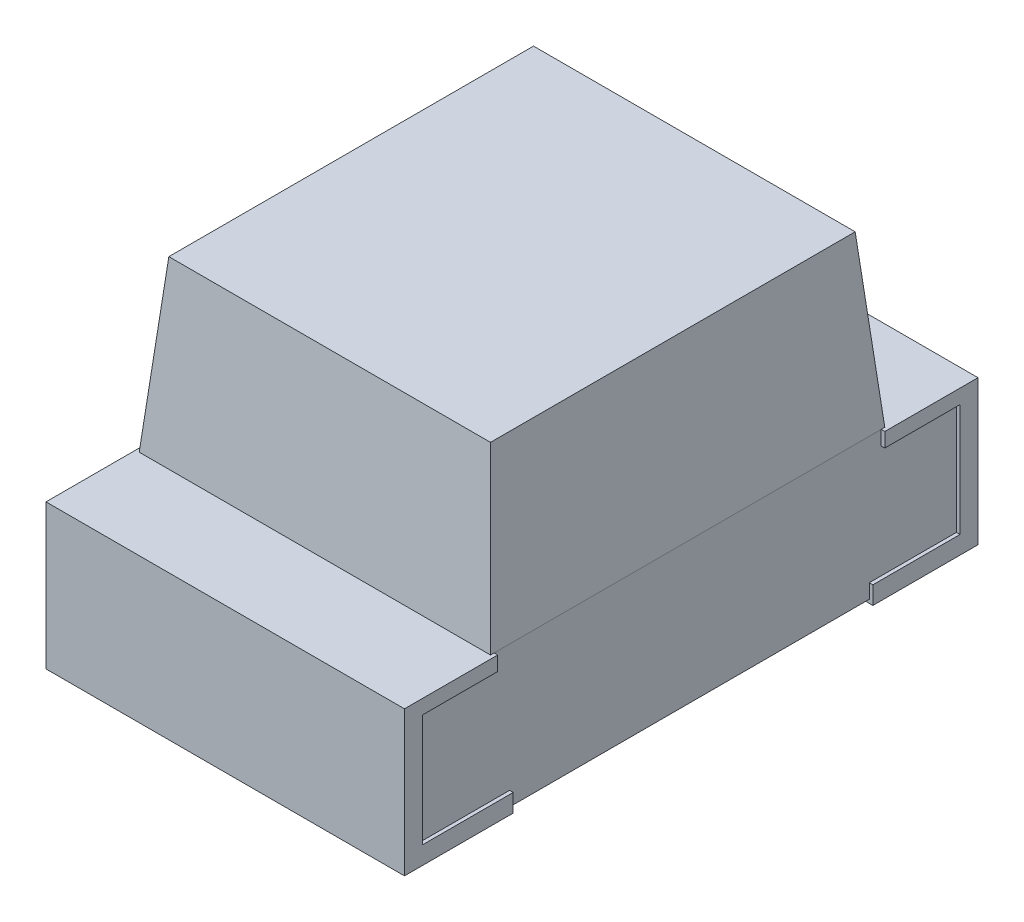
ISO-10303-21;
HEADER;
FILE_DESCRIPTION(('STEP AP214'),'2;1');
FILE_NAME('part.step','',(''),(''),'','','');
FILE_SCHEMA(('AUTOMOTIVE_DESIGN { 1 0 10303 214 1 1 1 1 }'));
ENDSEC;
DATA;
#1=APPLICATION_CONTEXT('core data for automotive mechanical design processes');
#2=APPLICATION_PROTOCOL_DEFINITION('international standard','automotive_design',2000,#1);
#3=PRODUCT_CONTEXT('',#1,'mechanical');
#4=PRODUCT('Part','Part','',(#3));
#5=PRODUCT_RELATED_PRODUCT_CATEGORY('part','',(#4));
#6=PRODUCT_DEFINITION_FORMATION('','',#4);
#7=PRODUCT_DEFINITION_CONTEXT('part definition',#1,'design');
#8=PRODUCT_DEFINITION('design','',#6,#7);
#9=PRODUCT_DEFINITION_SHAPE('','',#8);
#10=(LENGTH_UNIT() NAMED_UNIT(*) SI_UNIT(.MILLI.,.METRE.));
#11=(NAMED_UNIT(*) PLANE_ANGLE_UNIT() SI_UNIT($,.RADIAN.));
#12=(NAMED_UNIT(*) SI_UNIT($,.STERADIAN.) SOLID_ANGLE_UNIT());
#13=UNCERTAINTY_MEASURE_WITH_UNIT(LENGTH_MEASURE(1.E-05),#10,'distance_accuracy_value','');
#14=(GEOMETRIC_REPRESENTATION_CONTEXT(3) GLOBAL_UNCERTAINTY_ASSIGNED_CONTEXT((#13)) GLOBAL_UNIT_ASSIGNED_CONTEXT((#10,
#11,#12)) REPRESENTATION_CONTEXT('',''));
#15=CARTESIAN_POINT('',(0.,0.,0.));
#16=DIRECTION('',(0.,0.,1.));
#17=DIRECTION('',(1.,0.,0.));
#18=AXIS2_PLACEMENT_3D('',#15,#16,#17);
#19=CARTESIAN_POINT('',(-0.6223,0.4492,1.016));
#20=DIRECTION('',(0.,0.,1.));
#21=DIRECTION('',(1.,0.,0.));
#22=AXIS2_PLACEMENT_3D('',#19,#20,#21);
#23=PLANE('',#22);
#24=DIRECTION('',(1.,0.,0.));
#25=VECTOR('',#24,1.);
#26=CARTESIAN_POINT('',(0.6223,0.5,1.016));
#27=LINE('',#26,#25);
#28=CARTESIAN_POINT('',(-0.635,0.5,1.016));
#29=VERTEX_POINT('',#28);
#30=CARTESIAN_POINT('',(0.635,0.5,1.016));
#31=VERTEX_POINT('',#30);
#32=EDGE_CURVE('E20',#29,#31,#27,.T.);
#33=ORIENTED_EDGE('',*,*,#32,.F.);
#34=DIRECTION('',(0.,1.,0.));
#35=VECTOR('',#34,1.);
#36=CARTESIAN_POINT('',(-0.635,0.4492,1.016));
#37=LINE('',#36,#35);
#38=CARTESIAN_POINT('',(-0.635,-0.0127,1.016));
#39=VERTEX_POINT('',#38);
#40=EDGE_CURVE('E319',#39,#29,#37,.T.);
#41=ORIENTED_EDGE('',*,*,#40,.F.);
#42=DIRECTION('',(1.,0.,0.));
#43=VECTOR('',#42,1.);
#44=CARTESIAN_POINT('',(-0.6223,-0.0127,1.016));
#45=LINE('',#44,#43);
#46=CARTESIAN_POINT('',(0.635,-0.0127,1.016));
#47=VERTEX_POINT('',#46);
#48=EDGE_CURVE('E246',#47,#39,#45,.F.);
#49=ORIENTED_EDGE('',*,*,#48,.F.);
#50=DIRECTION('',(0.,1.,0.));
#51=VECTOR('',#50,1.);
#52=CARTESIAN_POINT('',(0.635,0.4492,1.016));
#53=LINE('',#52,#51);
#54=EDGE_CURVE('E224',#31,#47,#53,.F.);
#55=ORIENTED_EDGE('',*,*,#54,.F.);
#56=EDGE_LOOP('',(#33,#41,#49,#55));
#57=FACE_BOUND('',#56,.T.);
#58=ADVANCED_FACE('F17',(#57),#23,.T.);
#59=CARTESIAN_POINT('',(0.6223,0.4492,-1.016));
#60=DIRECTION('',(0.,0.,-1.));
#61=DIRECTION('',(-1.,0.,0.));
#62=AXIS2_PLACEMENT_3D('',#59,#60,#61);
#63=PLANE('',#62);
#64=DIRECTION('',(1.,0.,0.));
#65=VECTOR('',#64,1.);
#66=CARTESIAN_POINT('',(0.6223,0.5,-1.016));
#67=LINE('',#66,#65);
#68=CARTESIAN_POINT('',(0.635,0.5,-1.016));
#69=VERTEX_POINT('',#68);
#70=CARTESIAN_POINT('',(-0.635,0.5,-1.016));
#71=VERTEX_POINT('',#70);
#72=EDGE_CURVE('E243',#69,#71,#67,.F.);
#73=ORIENTED_EDGE('',*,*,#72,.F.);
#74=DIRECTION('',(0.,1.,0.));
#75=VECTOR('',#74,1.);
#76=CARTESIAN_POINT('',(0.635,0.4492,-1.016));
#77=LINE('',#76,#75);
#78=CARTESIAN_POINT('',(0.635,-0.0127,-1.016));
#79=VERTEX_POINT('',#78);
#80=EDGE_CURVE('E423',#79,#69,#77,.T.);
#81=ORIENTED_EDGE('',*,*,#80,.F.);
#82=DIRECTION('',(1.,0.,0.));
#83=VECTOR('',#82,1.);
#84=CARTESIAN_POINT('',(0.6223,-0.0127,-1.016));
#85=LINE('',#84,#83);
#86=CARTESIAN_POINT('',(-0.635,-0.0127,-1.016));
#87=VERTEX_POINT('',#86);
#88=EDGE_CURVE('E280',#87,#79,#85,.T.);
#89=ORIENTED_EDGE('',*,*,#88,.F.);
#90=DIRECTION('',(0.,1.,0.));
#91=VECTOR('',#90,1.);
#92=CARTESIAN_POINT('',(-0.635,0.4492,-1.016));
#93=LINE('',#92,#91);
#94=EDGE_CURVE('E401',#71,#87,#93,.F.);
#95=ORIENTED_EDGE('',*,*,#94,.F.);
#96=EDGE_LOOP('',(#73,#81,#89,#95));
#97=FACE_BOUND('',#96,.T.);
#98=ADVANCED_FACE('F581',(#97),#63,.T.);
#99=CARTESIAN_POINT('',(0.6223,0.5,-1.0033));
#100=DIRECTION('',(0.,1.,0.));
#101=DIRECTION('',(0.,0.,1.));
#102=AXIS2_PLACEMENT_3D('',#99,#100,#101);
#103=PLANE('',#102);
#104=ORIENTED_EDGE('',*,*,#32,.T.);
#105=DIRECTION('',(0.,0.,-1.));
#106=VECTOR('',#105,1.);
#107=CARTESIAN_POINT('',(0.635,0.5,0.6985));
#108=LINE('',#107,#106);
#109=CARTESIAN_POINT('',(0.635,0.5,0.6858));
#110=VERTEX_POINT('',#109);
#111=EDGE_CURVE('E233',#110,#31,#108,.F.);
#112=ORIENTED_EDGE('',*,*,#111,.F.);
#113=DIRECTION('',(-1.,0.,0.));
#114=VECTOR('',#113,1.);
#115=CARTESIAN_POINT('',(-0.6223,0.5,0.6858));
#116=LINE('',#115,#114);
#117=CARTESIAN_POINT('',(0.6223,0.5,0.6858));
#118=VERTEX_POINT('',#117);
#119=EDGE_CURVE('E278',#118,#110,#116,.F.);
#120=ORIENTED_EDGE('',*,*,#119,.F.);
#121=DIRECTION('',(0.,0.,1.));
#122=VECTOR('',#121,1.);
#123=CARTESIAN_POINT('',(0.6223,0.5,0.6985));
#124=LINE('',#123,#122);
#125=CARTESIAN_POINT('',(0.6223,0.5,0.6985));
#126=VERTEX_POINT('',#125);
#127=EDGE_CURVE('E273',#126,#118,#124,.F.);
#128=ORIENTED_EDGE('',*,*,#127,.F.);
#129=DIRECTION('',(1.,0.,0.));
#130=VECTOR('',#129,1.);
#131=CARTESIAN_POINT('',(0.6223,0.5,0.6985));
#132=LINE('',#131,#130);
#133=CARTESIAN_POINT('',(-0.6223,0.5,0.6985));
#134=VERTEX_POINT('',#133);
#135=EDGE_CURVE('E239',#134,#126,#132,.T.);
#136=ORIENTED_EDGE('',*,*,#135,.F.);
#137=DIRECTION('',(0.,0.,1.));
#138=VECTOR('',#137,1.);
#139=CARTESIAN_POINT('',(-0.6223,0.5,0.6985));
#140=LINE('',#139,#138);
#141=CARTESIAN_POINT('',(-0.6223,0.5,0.6858));
#142=VERTEX_POINT('',#141);
#143=EDGE_CURVE('E379',#142,#134,#140,.T.);
#144=ORIENTED_EDGE('',*,*,#143,.F.);
#145=DIRECTION('',(-1.,0.,0.));
#146=VECTOR('',#145,1.);
#147=CARTESIAN_POINT('',(-0.6223,0.5,0.6858));
#148=LINE('',#147,#146);
#149=CARTESIAN_POINT('',(-0.635,0.5,0.6858));
#150=VERTEX_POINT('',#149);
#151=EDGE_CURVE('E381',#150,#142,#148,.F.);
#152=ORIENTED_EDGE('',*,*,#151,.F.);
#153=DIRECTION('',(0.,0.,1.));
#154=VECTOR('',#153,1.);
#155=CARTESIAN_POINT('',(-0.635,0.5,0.6985));
#156=LINE('',#155,#154);
#157=EDGE_CURVE('E236',#29,#150,#156,.F.);
#158=ORIENTED_EDGE('',*,*,#157,.F.);
#159=EDGE_LOOP('',(#104,#112,#120,#128,#136,#144,#152,#158));
#160=FACE_BOUND('',#159,.T.);
#161=ADVANCED_FACE('F231',(#160),#103,.T.);
#162=CARTESIAN_POINT('',(0.6223,0.5,0.6985));
#163=DIRECTION('',(0.,0.0871557427476379,0.996194698091747));
#164=DIRECTION('',(0.,-0.996194698091747,0.0871557427476379));
#165=AXIS2_PLACEMENT_3D('',#162,#163,#164);
#166=PLANE('',#165);
#167=DIRECTION('',(1.,0.,0.));
#168=VECTOR('',#167,1.);
#169=CARTESIAN_POINT('',(0.6223,1.1,0.646006801884));
#170=LINE('',#169,#168);
#171=CARTESIAN_POINT('',(-0.569806801884114,1.10000000000003,0.646006801884227));
#172=VERTEX_POINT('',#171);
#173=CARTESIAN_POINT('',(0.569806801884114,1.10000000000002,0.646006801884114));
#174=VERTEX_POINT('',#173);
#175=EDGE_CURVE('E257',#172,#174,#170,.T.);
#176=ORIENTED_EDGE('',*,*,#175,.F.);
#177=DIRECTION('',(0.0868265938642219,0.992432509138906,-0.0868265938649737));
#178=VECTOR('',#177,1.);
#179=CARTESIAN_POINT('',(-0.6223,0.5,0.6985));
#180=LINE('',#179,#178);
#181=EDGE_CURVE('E266',#134,#172,#180,.T.);
#182=ORIENTED_EDGE('',*,*,#181,.F.);
#183=ORIENTED_EDGE('',*,*,#135,.T.);
#184=DIRECTION('',(0.0868265938642219,-0.992432509138906,0.0868265938649737));
#185=VECTOR('',#184,1.);
#186=CARTESIAN_POINT('',(0.569806801884454,1.10000000000004,0.646006801884));
#187=LINE('',#186,#185);
#188=EDGE_CURVE('E265',#174,#126,#187,.T.);
#189=ORIENTED_EDGE('',*,*,#188,.F.);
#190=EDGE_LOOP('',(#176,#182,#183,#189));
#191=FACE_BOUND('',#190,.T.);
#192=ADVANCED_FACE('F264',(#191),#166,.T.);
#193=CARTESIAN_POINT('',(0.6223,1.1,-0.6985));
#194=DIRECTION('',(0.,1.,0.));
#195=DIRECTION('',(0.,0.,1.));
#196=AXIS2_PLACEMENT_3D('',#193,#194,#195);
#197=PLANE('',#196);
#198=DIRECTION('',(0.,0.,1.));
#199=VECTOR('',#198,1.);
#200=CARTESIAN_POINT('',(-0.569806801884454,1.10000000000004,0.6985));
#201=LINE('',#200,#199);
#202=CARTESIAN_POINT('',(-0.569806801884114,1.10000000000002,-0.646006801884114));
#203=VERTEX_POINT('',#202);
#204=EDGE_CURVE('E376',#172,#203,#201,.F.);
#205=ORIENTED_EDGE('',*,*,#204,.F.);
#206=ORIENTED_EDGE('',*,*,#175,.T.);
#207=DIRECTION('',(0.,0.,1.));
#208=VECTOR('',#207,1.);
#209=CARTESIAN_POINT('',(0.569806801884454,1.10000000000004,0.6985));
#210=LINE('',#209,#208);
#211=CARTESIAN_POINT('',(0.569806801884114,1.10000000000003,-0.646006801884227));
#212=VERTEX_POINT('',#211);
#213=EDGE_CURVE('E276',#212,#174,#210,.T.);
#214=ORIENTED_EDGE('',*,*,#213,.F.);
#215=DIRECTION('',(1.,0.,0.));
#216=VECTOR('',#215,1.);
#217=CARTESIAN_POINT('',(0.6223,1.10000000000004,-0.646006801884454));
#218=LINE('',#217,#216);
#219=EDGE_CURVE('E255',#203,#212,#218,.T.);
#220=ORIENTED_EDGE('',*,*,#219,.F.);
#221=EDGE_LOOP('',(#205,#206,#214,#220));
#222=FACE_BOUND('',#221,.T.);
#223=ADVANCED_FACE('F548',(#222),#197,.T.);
#224=CARTESIAN_POINT('',(0.6223,0.5,-0.6985));
#225=DIRECTION('',(0.,0.0871557427476379,-0.996194698091747));
#226=DIRECTION('',(0.,0.996194698091747,0.0871557427476379));
#227=AXIS2_PLACEMENT_3D('',#224,#225,#226);
#228=PLANE('',#227);
#229=ORIENTED_EDGE('',*,*,#219,.T.);
#230=DIRECTION('',(-0.0868265938642219,0.992432509138906,0.0868265938649739));
#231=VECTOR('',#230,1.);
#232=CARTESIAN_POINT('',(0.6223,0.5,-0.6985));
#233=LINE('',#232,#231);
#234=CARTESIAN_POINT('',(0.6223,0.5,-0.6985));
#235=VERTEX_POINT('',#234);
#236=EDGE_CURVE('E287',#235,#212,#233,.T.);
#237=ORIENTED_EDGE('',*,*,#236,.F.);
#238=DIRECTION('',(1.,0.,0.));
#239=VECTOR('',#238,1.);
#240=CARTESIAN_POINT('',(0.6223,0.5,-0.6985));
#241=LINE('',#240,#239);
#242=CARTESIAN_POINT('',(-0.6223,0.5,-0.6985));
#243=VERTEX_POINT('',#242);
#244=EDGE_CURVE('E253',#243,#235,#241,.T.);
#245=ORIENTED_EDGE('',*,*,#244,.F.);
#246=DIRECTION('',(-0.0868265938642219,-0.992432509138906,-0.0868265938649739));
#247=VECTOR('',#246,1.);
#248=CARTESIAN_POINT('',(-0.569806801884454,1.10000000000004,-0.646006801884));
#249=LINE('',#248,#247);
#250=EDGE_CURVE('E374',#203,#243,#249,.T.);
#251=ORIENTED_EDGE('',*,*,#250,.F.);
#252=EDGE_LOOP('',(#229,#237,#245,#251));
#253=FACE_BOUND('',#252,.T.);
#254=ADVANCED_FACE('F543',(#253),#228,.T.);
#255=CARTESIAN_POINT('',(0.6223,0.5,-1.0033));
#256=DIRECTION('',(0.,1.,0.));
#257=DIRECTION('',(0.,0.,1.));
#258=AXIS2_PLACEMENT_3D('',#255,#256,#257);
#259=PLANE('',#258);
#260=ORIENTED_EDGE('',*,*,#72,.T.);
#261=DIRECTION('',(0.,0.,1.));
#262=VECTOR('',#261,1.);
#263=CARTESIAN_POINT('',(-0.635,0.5,-0.6985));
#264=LINE('',#263,#262);
#265=CARTESIAN_POINT('',(-0.635,0.5,-0.6858));
#266=VERTEX_POINT('',#265);
#267=EDGE_CURVE('E404',#266,#71,#264,.F.);
#268=ORIENTED_EDGE('',*,*,#267,.F.);
#269=DIRECTION('',(1.,0.,0.));
#270=VECTOR('',#269,1.);
#271=CARTESIAN_POINT('',(0.6223,0.5,-0.6858));
#272=LINE('',#271,#270);
#273=CARTESIAN_POINT('',(-0.6223,0.5,-0.6858));
#274=VERTEX_POINT('',#273);
#275=EDGE_CURVE('E370',#274,#266,#272,.F.);
#276=ORIENTED_EDGE('',*,*,#275,.F.);
#277=DIRECTION('',(0.,0.,1.));
#278=VECTOR('',#277,1.);
#279=CARTESIAN_POINT('',(-0.6223,0.5,0.6985));
#280=LINE('',#279,#278);
#281=EDGE_CURVE('E372',#243,#274,#280,.T.);
#282=ORIENTED_EDGE('',*,*,#281,.F.);
#283=ORIENTED_EDGE('',*,*,#244,.T.);
#284=DIRECTION('',(0.,0.,1.));
#285=VECTOR('',#284,1.);
#286=CARTESIAN_POINT('',(0.6223,0.5,0.6985));
#287=LINE('',#286,#285);
#288=CARTESIAN_POINT('',(0.6223,0.5,-0.6858));
#289=VERTEX_POINT('',#288);
#290=EDGE_CURVE('E289',#289,#235,#287,.F.);
#291=ORIENTED_EDGE('',*,*,#290,.F.);
#292=DIRECTION('',(1.,0.,0.));
#293=VECTOR('',#292,1.);
#294=CARTESIAN_POINT('',(0.6223,0.5,-0.6858));
#295=LINE('',#294,#293);
#296=CARTESIAN_POINT('',(0.635,0.5,-0.6858));
#297=VERTEX_POINT('',#296);
#298=EDGE_CURVE('E292',#297,#289,#295,.F.);
#299=ORIENTED_EDGE('',*,*,#298,.F.);
#300=DIRECTION('',(0.,0.,-1.));
#301=VECTOR('',#300,1.);
#302=CARTESIAN_POINT('',(0.635,0.5,-0.6985));
#303=LINE('',#302,#301);
#304=EDGE_CURVE('E421',#69,#297,#303,.F.);
#305=ORIENTED_EDGE('',*,*,#304,.F.);
#306=EDGE_LOOP('',(#260,#268,#276,#282,#283,#291,#299,#305));
#307=FACE_BOUND('',#306,.T.);
#308=ADVANCED_FACE('F536',(#307),#259,.T.);
#309=CARTESIAN_POINT('',(0.635,0.4492,0.6985));
#310=DIRECTION('',(1.,0.,0.));
#311=DIRECTION('',(0.,0.,-1.));
#312=AXIS2_PLACEMENT_3D('',#309,#310,#311);
#313=PLANE('',#312);
#314=ORIENTED_EDGE('',*,*,#111,.T.);
#315=ORIENTED_EDGE('',*,*,#54,.T.);
#316=DIRECTION('',(0.,0.,-1.));
#317=VECTOR('',#316,1.);
#318=CARTESIAN_POINT('',(0.635,-0.0127,0.9525));
#319=LINE('',#318,#317);
#320=CARTESIAN_POINT('',(0.635,-0.0127,0.630803158));
#321=VERTEX_POINT('',#320);
#322=EDGE_CURVE('E247',#321,#47,#319,.F.);
#323=ORIENTED_EDGE('',*,*,#322,.F.);
#324=DIRECTION('',(0.,1.,0.));
#325=VECTOR('',#324,1.);
#326=CARTESIAN_POINT('',(0.635,0.0508,0.630803158));
#327=LINE('',#326,#325);
#328=CARTESIAN_POINT('',(0.635,0.0508,0.630803158));
#329=VERTEX_POINT('',#328);
#330=EDGE_CURVE('E342',#329,#321,#327,.F.);
#331=ORIENTED_EDGE('',*,*,#330,.F.);
#332=DIRECTION('',(0.,0.,-1.));
#333=VECTOR('',#332,1.);
#334=CARTESIAN_POINT('',(0.635,0.0508,0.630803158));
#335=LINE('',#334,#333);
#336=CARTESIAN_POINT('',(0.635,0.0508,0.9525));
#337=VERTEX_POINT('',#336);
#338=EDGE_CURVE('E302',#329,#337,#335,.F.);
#339=ORIENTED_EDGE('',*,*,#338,.T.);
#340=DIRECTION('',(0.,1.,0.));
#341=VECTOR('',#340,1.);
#342=CARTESIAN_POINT('',(0.635,-0.0127,0.9525));
#343=LINE('',#342,#341);
#344=CARTESIAN_POINT('',(0.635,0.4492,0.9525));
#345=VERTEX_POINT('',#344);
#346=EDGE_CURVE('E308',#337,#345,#343,.T.);
#347=ORIENTED_EDGE('',*,*,#346,.T.);
#348=DIRECTION('',(0.,0.,1.));
#349=VECTOR('',#348,1.);
#350=CARTESIAN_POINT('',(0.635,0.4492,1.016));
#351=LINE('',#350,#349);
#352=CARTESIAN_POINT('',(0.635,0.4492,0.6858));
#353=VERTEX_POINT('',#352);
#354=EDGE_CURVE('E314',#345,#353,#351,.F.);
#355=ORIENTED_EDGE('',*,*,#354,.T.);
#356=DIRECTION('',(0.,1.,0.));
#357=VECTOR('',#356,1.);
#358=CARTESIAN_POINT('',(0.635,0.4492,0.6858));
#359=LINE('',#358,#357);
#360=EDGE_CURVE('E242',#110,#353,#359,.F.);
#361=ORIENTED_EDGE('',*,*,#360,.F.);
#362=EDGE_LOOP('',(#314,#315,#323,#331,#339,#347,#355,#361));
#363=FACE_BOUND('',#362,.T.);
#364=ADVANCED_FACE('F240',(#363),#313,.T.);
#365=CARTESIAN_POINT('',(-0.6223,-0.0127,0.9525));
#366=DIRECTION('',(0.,-1.,0.));
#367=DIRECTION('',(0.,0.,-1.));
#368=AXIS2_PLACEMENT_3D('',#365,#366,#367);
#369=PLANE('',#368);
#370=ORIENTED_EDGE('',*,*,#322,.T.);
#371=ORIENTED_EDGE('',*,*,#48,.T.);
#372=DIRECTION('',(0.,0.,1.));
#373=VECTOR('',#372,1.);
#374=CARTESIAN_POINT('',(-0.635,-0.0127,0.6985));
#375=LINE('',#374,#373);
#376=CARTESIAN_POINT('',(-0.635,-0.0127,0.630803158));
#377=VERTEX_POINT('',#376);
#378=EDGE_CURVE('E321',#377,#39,#375,.T.);
#379=ORIENTED_EDGE('',*,*,#378,.F.);
#380=DIRECTION('',(-1.,0.,0.));
#381=VECTOR('',#380,1.);
#382=CARTESIAN_POINT('',(-0.6223,-0.0127,0.630803158));
#383=LINE('',#382,#381);
#384=EDGE_CURVE('E338',#321,#377,#383,.T.);
#385=ORIENTED_EDGE('',*,*,#384,.F.);
#386=EDGE_LOOP('',(#370,#371,#379,#385));
#387=FACE_BOUND('',#386,.T.);
#388=ADVANCED_FACE('F325',(#387),#369,.T.);
#389=CARTESIAN_POINT('',(-0.635,0.4492,0.6985));
#390=DIRECTION('',(-1.,0.,0.));
#391=DIRECTION('',(0.,0.,1.));
#392=AXIS2_PLACEMENT_3D('',#389,#390,#391);
#393=PLANE('',#392);
#394=DIRECTION('',(0.,1.,0.));
#395=VECTOR('',#394,1.);
#396=CARTESIAN_POINT('',(-0.635,0.4492,0.6858));
#397=LINE('',#396,#395);
#398=CARTESIAN_POINT('',(-0.635,0.4492,0.6858));
#399=VERTEX_POINT('',#398);
#400=EDGE_CURVE('E383',#399,#150,#397,.T.);
#401=ORIENTED_EDGE('',*,*,#400,.F.);
#402=DIRECTION('',(0.,0.,1.));
#403=VECTOR('',#402,1.);
#404=CARTESIAN_POINT('',(-0.635,0.4492,1.016));
#405=LINE('',#404,#403);
#406=CARTESIAN_POINT('',(-0.635,0.4492,0.9525));
#407=VERTEX_POINT('',#406);
#408=EDGE_CURVE('E389',#399,#407,#405,.T.);
#409=ORIENTED_EDGE('',*,*,#408,.T.);
#410=DIRECTION('',(0.,1.,0.));
#411=VECTOR('',#410,1.);
#412=CARTESIAN_POINT('',(-0.635,-0.0127,0.9525));
#413=LINE('',#412,#411);
#414=CARTESIAN_POINT('',(-0.635,0.0508,0.9525));
#415=VERTEX_POINT('',#414);
#416=EDGE_CURVE('E395',#407,#415,#413,.F.);
#417=ORIENTED_EDGE('',*,*,#416,.T.);
#418=DIRECTION('',(0.,0.,-1.));
#419=VECTOR('',#418,1.);
#420=CARTESIAN_POINT('',(-0.635,0.0508,0.630803158));
#421=LINE('',#420,#419);
#422=CARTESIAN_POINT('',(-0.635,0.0508,0.630803158));
#423=VERTEX_POINT('',#422);
#424=EDGE_CURVE('E334',#415,#423,#421,.T.);
#425=ORIENTED_EDGE('',*,*,#424,.T.);
#426=DIRECTION('',(0.,1.,0.));
#427=VECTOR('',#426,1.);
#428=CARTESIAN_POINT('',(-0.635,0.0508,0.630803158));
#429=LINE('',#428,#427);
#430=EDGE_CURVE('E332',#377,#423,#429,.T.);
#431=ORIENTED_EDGE('',*,*,#430,.F.);
#432=ORIENTED_EDGE('',*,*,#378,.T.);
#433=ORIENTED_EDGE('',*,*,#40,.T.);
#434=ORIENTED_EDGE('',*,*,#157,.T.);
#435=EDGE_LOOP('',(#401,#409,#417,#425,#431,#432,#433,#434));
#436=FACE_BOUND('',#435,.T.);
#437=ADVANCED_FACE('F330',(#436),#393,.T.);
#438=CARTESIAN_POINT('',(-0.6223,0.4492,0.6858));
#439=DIRECTION('',(0.,0.,-1.));
#440=DIRECTION('',(-1.,0.,0.));
#441=AXIS2_PLACEMENT_3D('',#438,#439,#440);
#442=PLANE('',#441);
#443=DIRECTION('',(1.,0.,0.));
#444=VECTOR('',#443,1.);
#445=CARTESIAN_POINT('',(-0.635,0.4492,0.6858));
#446=LINE('',#445,#444);
#447=CARTESIAN_POINT('',(0.6223,0.4492,0.6858));
#448=VERTEX_POINT('',#447);
#449=EDGE_CURVE('E311',#353,#448,#446,.F.);
#450=ORIENTED_EDGE('',*,*,#449,.T.);
#451=DIRECTION('',(0.,1.,0.));
#452=VECTOR('',#451,1.);
#453=CARTESIAN_POINT('',(0.6223,0.5,0.6858));
#454=LINE('',#453,#452);
#455=EDGE_CURVE('E340',#118,#448,#454,.F.);
#456=ORIENTED_EDGE('',*,*,#455,.F.);
#457=ORIENTED_EDGE('',*,*,#119,.T.);
#458=ORIENTED_EDGE('',*,*,#360,.T.);
#459=EDGE_LOOP('',(#450,#456,#457,#458));
#460=FACE_BOUND('',#459,.T.);
#461=ADVANCED_FACE('F467',(#460),#442,.T.);
#462=CARTESIAN_POINT('',(-0.635,0.4492,1.016));
#463=DIRECTION('',(0.,1.,0.));
#464=DIRECTION('',(0.,0.,1.));
#465=AXIS2_PLACEMENT_3D('',#462,#463,#464);
#466=PLANE('',#465);
#467=ORIENTED_EDGE('',*,*,#449,.F.);
#468=ORIENTED_EDGE('',*,*,#354,.F.);
#469=DIRECTION('',(1.,0.,0.));
#470=VECTOR('',#469,1.);
#471=CARTESIAN_POINT('',(-0.635,0.4492,0.9525));
#472=LINE('',#471,#470);
#473=CARTESIAN_POINT('',(0.6223,0.4492,0.9525));
#474=VERTEX_POINT('',#473);
#475=EDGE_CURVE('E305',#345,#474,#472,.F.);
#476=ORIENTED_EDGE('',*,*,#475,.T.);
#477=DIRECTION('',(0.,0.,-1.));
#478=VECTOR('',#477,1.);
#479=CARTESIAN_POINT('',(0.6223,0.4492,1.0033));
#480=LINE('',#479,#478);
#481=EDGE_CURVE('E459',#448,#474,#480,.F.);
#482=ORIENTED_EDGE('',*,*,#481,.F.);
#483=EDGE_LOOP('',(#467,#468,#476,#482));
#484=FACE_BOUND('',#483,.T.);
#485=ADVANCED_FACE('F469',(#484),#466,.F.);
#486=CARTESIAN_POINT('',(-0.635,-0.0127,0.9525));
#487=DIRECTION('',(0.,0.,1.));
#488=DIRECTION('',(1.,0.,0.));
#489=AXIS2_PLACEMENT_3D('',#486,#487,#488);
#490=PLANE('',#489);
#491=ORIENTED_EDGE('',*,*,#475,.F.);
#492=ORIENTED_EDGE('',*,*,#346,.F.);
#493=DIRECTION('',(1.,0.,0.));
#494=VECTOR('',#493,1.);
#495=CARTESIAN_POINT('',(-0.635,0.0508,0.9525));
#496=LINE('',#495,#494);
#497=CARTESIAN_POINT('',(0.6223,0.0508,0.9525));
#498=VERTEX_POINT('',#497);
#499=EDGE_CURVE('E299',#337,#498,#496,.F.);
#500=ORIENTED_EDGE('',*,*,#499,.T.);
#501=DIRECTION('',(0.,1.,0.));
#502=VECTOR('',#501,1.);
#503=CARTESIAN_POINT('',(0.6223,0.5,0.9525));
#504=LINE('',#503,#502);
#505=EDGE_CURVE('E457',#474,#498,#504,.F.);
#506=ORIENTED_EDGE('',*,*,#505,.F.);
#507=EDGE_LOOP('',(#491,#492,#500,#506));
#508=FACE_BOUND('',#507,.T.);
#509=ADVANCED_FACE('F473',(#508),#490,.F.);
#510=CARTESIAN_POINT('',(-0.635,0.0508,0.630803158));
#511=DIRECTION('',(0.,-1.,0.));
#512=DIRECTION('',(0.,0.,-1.));
#513=AXIS2_PLACEMENT_3D('',#510,#511,#512);
#514=PLANE('',#513);
#515=ORIENTED_EDGE('',*,*,#338,.F.);
#516=DIRECTION('',(-1.,0.,0.));
#517=VECTOR('',#516,1.);
#518=CARTESIAN_POINT('',(-0.6223,0.0508,0.630803158));
#519=LINE('',#518,#517);
#520=CARTESIAN_POINT('',(0.6223,0.0508,0.630803158));
#521=VERTEX_POINT('',#520);
#522=EDGE_CURVE('E347',#521,#329,#519,.F.);
#523=ORIENTED_EDGE('',*,*,#522,.F.);
#524=DIRECTION('',(0.,0.,-1.));
#525=VECTOR('',#524,1.);
#526=CARTESIAN_POINT('',(0.6223,0.0508,1.0033));
#527=LINE('',#526,#525);
#528=EDGE_CURVE('E455',#498,#521,#527,.T.);
#529=ORIENTED_EDGE('',*,*,#528,.F.);
#530=ORIENTED_EDGE('',*,*,#499,.F.);
#531=EDGE_LOOP('',(#515,#523,#529,#530));
#532=FACE_BOUND('',#531,.T.);
#533=ADVANCED_FACE('F481',(#532),#514,.F.);
#534=CARTESIAN_POINT('',(0.635,-0.0127,-0.9525));
#535=DIRECTION('',(0.,0.,-1.));
#536=DIRECTION('',(-1.,0.,0.));
#537=AXIS2_PLACEMENT_3D('',#534,#535,#536);
#538=PLANE('',#537);
#539=DIRECTION('',(1.,0.,0.));
#540=VECTOR('',#539,1.);
#541=CARTESIAN_POINT('',(0.635,0.4492,-0.9525));
#542=LINE('',#541,#540);
#543=CARTESIAN_POINT('',(0.635,0.4492,-0.9525));
#544=VERTEX_POINT('',#543);
#545=CARTESIAN_POINT('',(0.6223,0.4492,-0.9525));
#546=VERTEX_POINT('',#545);
#547=EDGE_CURVE('E296',#544,#546,#542,.F.);
#548=ORIENTED_EDGE('',*,*,#547,.T.);
#549=DIRECTION('',(0.,1.,0.));
#550=VECTOR('',#549,1.);
#551=CARTESIAN_POINT('',(0.6223,0.5,-0.9525));
#552=LINE('',#551,#550);
#553=CARTESIAN_POINT('',(0.6223,0.0508,-0.9525));
#554=VERTEX_POINT('',#553);
#555=EDGE_CURVE('E442',#554,#546,#552,.T.);
#556=ORIENTED_EDGE('',*,*,#555,.F.);
#557=DIRECTION('',(1.,0.,0.));
#558=VECTOR('',#557,1.);
#559=CARTESIAN_POINT('',(0.635,0.0508,-0.9525));
#560=LINE('',#559,#558);
#561=CARTESIAN_POINT('',(0.635,0.0508,-0.9525));
#562=VERTEX_POINT('',#561);
#563=EDGE_CURVE('E412',#554,#562,#560,.T.);
#564=ORIENTED_EDGE('',*,*,#563,.T.);
#565=DIRECTION('',(0.,1.,0.));
#566=VECTOR('',#565,1.);
#567=CARTESIAN_POINT('',(0.635,0.4492,-0.9525));
#568=LINE('',#567,#566);
#569=EDGE_CURVE('E282',#544,#562,#568,.F.);
#570=ORIENTED_EDGE('',*,*,#569,.F.);
#571=EDGE_LOOP('',(#548,#556,#564,#570));
#572=FACE_BOUND('',#571,.T.);
#573=ADVANCED_FACE('F441',(#572),#538,.F.);
#574=CARTESIAN_POINT('',(0.635,0.4492,-1.016));
#575=DIRECTION('',(0.,1.,0.));
#576=DIRECTION('',(0.,0.,1.));
#577=AXIS2_PLACEMENT_3D('',#574,#575,#576);
#578=PLANE('',#577);
#579=DIRECTION('',(1.,0.,0.));
#580=VECTOR('',#579,1.);
#581=CARTESIAN_POINT('',(0.6223,0.4492,-0.6858));
#582=LINE('',#581,#580);
#583=CARTESIAN_POINT('',(0.6223,0.4492,-0.6858));
#584=VERTEX_POINT('',#583);
#585=CARTESIAN_POINT('',(0.635,0.4492,-0.6858));
#586=VERTEX_POINT('',#585);
#587=EDGE_CURVE('E294',#584,#586,#582,.T.);
#588=ORIENTED_EDGE('',*,*,#587,.F.);
#589=DIRECTION('',(0.,0.,-1.));
#590=VECTOR('',#589,1.);
#591=CARTESIAN_POINT('',(0.6223,0.4492,1.0033));
#592=LINE('',#591,#590);
#593=EDGE_CURVE('E445',#546,#584,#592,.F.);
#594=ORIENTED_EDGE('',*,*,#593,.F.);
#595=ORIENTED_EDGE('',*,*,#547,.F.);
#596=DIRECTION('',(0.,0.,-1.));
#597=VECTOR('',#596,1.);
#598=CARTESIAN_POINT('',(0.635,0.4492,-0.6985));
#599=LINE('',#598,#597);
#600=EDGE_CURVE('E415',#586,#544,#599,.T.);
#601=ORIENTED_EDGE('',*,*,#600,.F.);
#602=EDGE_LOOP('',(#588,#594,#595,#601));
#603=FACE_BOUND('',#602,.T.);
#604=ADVANCED_FACE('F585',(#603),#578,.F.);
#605=CARTESIAN_POINT('',(0.6223,0.4492,-0.6858));
#606=DIRECTION('',(0.,0.,1.));
#607=DIRECTION('',(1.,0.,0.));
#608=AXIS2_PLACEMENT_3D('',#605,#606,#607);
#609=PLANE('',#608);
#610=ORIENTED_EDGE('',*,*,#298,.T.);
#611=DIRECTION('',(0.,1.,0.));
#612=VECTOR('',#611,1.);
#613=CARTESIAN_POINT('',(0.6223,0.5,-0.6858));
#614=LINE('',#613,#612);
#615=EDGE_CURVE('E448',#584,#289,#614,.T.);
#616=ORIENTED_EDGE('',*,*,#615,.F.);
#617=ORIENTED_EDGE('',*,*,#587,.T.);
#618=DIRECTION('',(0.,1.,0.));
#619=VECTOR('',#618,1.);
#620=CARTESIAN_POINT('',(0.635,0.4492,-0.6858));
#621=LINE('',#620,#619);
#622=EDGE_CURVE('E418',#297,#586,#621,.F.);
#623=ORIENTED_EDGE('',*,*,#622,.F.);
#624=EDGE_LOOP('',(#610,#616,#617,#623));
#625=FACE_BOUND('',#624,.T.);
#626=ADVANCED_FACE('F586',(#625),#609,.T.);
#627=CARTESIAN_POINT('',(0.6223,0.5,0.6985));
#628=DIRECTION('',(0.996194698091747,0.0871557427476379,0.));
#629=DIRECTION('',(-0.0871557427476379,0.996194698091747,0.));
#630=AXIS2_PLACEMENT_3D('',#627,#628,#629);
#631=PLANE('',#630);
#632=ORIENTED_EDGE('',*,*,#127,.T.);
#633=DIRECTION('',(0.,0.,-1.));
#634=VECTOR('',#633,1.);
#635=CARTESIAN_POINT('',(0.6223,0.5,1.0033));
#636=LINE('',#635,#634);
#637=EDGE_CURVE('E464',#289,#118,#636,.F.);
#638=ORIENTED_EDGE('',*,*,#637,.F.);
#639=ORIENTED_EDGE('',*,*,#290,.T.);
#640=ORIENTED_EDGE('',*,*,#236,.T.);
#641=ORIENTED_EDGE('',*,*,#213,.T.);
#642=ORIENTED_EDGE('',*,*,#188,.T.);
#643=EDGE_LOOP('',(#632,#638,#639,#640,#641,#642));
#644=FACE_BOUND('',#643,.T.);
#645=ADVANCED_FACE('F271',(#644),#631,.T.);
#646=CARTESIAN_POINT('',(0.6223,-0.0127,-0.9525));
#647=DIRECTION('',(0.,-1.,0.));
#648=DIRECTION('',(0.,0.,-1.));
#649=AXIS2_PLACEMENT_3D('',#646,#647,#648);
#650=PLANE('',#649);
#651=DIRECTION('',(0.,0.,1.));
#652=VECTOR('',#651,1.);
#653=CARTESIAN_POINT('',(-0.635,-0.0127,-0.6985));
#654=LINE('',#653,#652);
#655=CARTESIAN_POINT('',(-0.635,-0.0127,-0.643503046468));
#656=VERTEX_POINT('',#655);
#657=EDGE_CURVE('E407',#87,#656,#654,.T.);
#658=ORIENTED_EDGE('',*,*,#657,.F.);
#659=ORIENTED_EDGE('',*,*,#88,.T.);
#660=DIRECTION('',(0.,0.,-1.));
#661=VECTOR('',#660,1.);
#662=CARTESIAN_POINT('',(0.635,-0.0127,-0.6985));
#663=LINE('',#662,#661);
#664=CARTESIAN_POINT('',(0.635,-0.0127,-0.643503046468));
#665=VERTEX_POINT('',#664);
#666=EDGE_CURVE('E425',#665,#79,#663,.T.);
#667=ORIENTED_EDGE('',*,*,#666,.F.);
#668=DIRECTION('',(1.,0.,0.));
#669=VECTOR('',#668,1.);
#670=CARTESIAN_POINT('',(0.6223,-0.0127,-0.643503046468));
#671=LINE('',#670,#669);
#672=EDGE_CURVE('E528',#656,#665,#671,.T.);
#673=ORIENTED_EDGE('',*,*,#672,.F.);
#674=EDGE_LOOP('',(#658,#659,#667,#673));
#675=FACE_BOUND('',#674,.T.);
#676=ADVANCED_FACE('F594',(#675),#650,.T.);
#677=CARTESIAN_POINT('',(0.635,0.4492,-0.6985));
#678=DIRECTION('',(1.,0.,0.));
#679=DIRECTION('',(0.,0.,-1.));
#680=AXIS2_PLACEMENT_3D('',#677,#678,#679);
#681=PLANE('',#680);
#682=ORIENTED_EDGE('',*,*,#622,.T.);
#683=ORIENTED_EDGE('',*,*,#600,.T.);
#684=ORIENTED_EDGE('',*,*,#569,.T.);
#685=DIRECTION('',(0.,0.,-1.));
#686=VECTOR('',#685,1.);
#687=CARTESIAN_POINT('',(0.635,0.0508,-0.643503046468));
#688=LINE('',#687,#686);
#689=CARTESIAN_POINT('',(0.635,0.0508,-0.643503046468));
#690=VERTEX_POINT('',#689);
#691=EDGE_CURVE('E409',#562,#690,#688,.F.);
#692=ORIENTED_EDGE('',*,*,#691,.T.);
#693=DIRECTION('',(0.,1.,0.));
#694=VECTOR('',#693,1.);
#695=CARTESIAN_POINT('',(0.635,0.0508,-0.643503046468));
#696=LINE('',#695,#694);
#697=EDGE_CURVE('E526',#665,#690,#696,.T.);
#698=ORIENTED_EDGE('',*,*,#697,.F.);
#699=ORIENTED_EDGE('',*,*,#666,.T.);
#700=ORIENTED_EDGE('',*,*,#80,.T.);
#701=ORIENTED_EDGE('',*,*,#304,.T.);
#702=EDGE_LOOP('',(#682,#683,#684,#692,#698,#699,#700,#701));
#703=FACE_BOUND('',#702,.T.);
#704=ADVANCED_FACE('F430',(#703),#681,.T.);
#705=CARTESIAN_POINT('',(0.635,0.0508,-0.643503046468));
#706=DIRECTION('',(0.,-1.,0.));
#707=DIRECTION('',(0.,0.,-1.));
#708=AXIS2_PLACEMENT_3D('',#705,#706,#707);
#709=PLANE('',#708);
#710=ORIENTED_EDGE('',*,*,#691,.F.);
#711=ORIENTED_EDGE('',*,*,#563,.F.);
#712=DIRECTION('',(0.,0.,-1.));
#713=VECTOR('',#712,1.);
#714=CARTESIAN_POINT('',(0.6223,0.0508,1.0033));
#715=LINE('',#714,#713);
#716=CARTESIAN_POINT('',(0.6223,0.0508,-0.643503046468));
#717=VERTEX_POINT('',#716);
#718=EDGE_CURVE('E446',#717,#554,#715,.T.);
#719=ORIENTED_EDGE('',*,*,#718,.F.);
#720=DIRECTION('',(1.,0.,0.));
#721=VECTOR('',#720,1.);
#722=CARTESIAN_POINT('',(0.6223,0.0508,-0.643503046468));
#723=LINE('',#722,#721);
#724=EDGE_CURVE('E439',#690,#717,#723,.F.);
#725=ORIENTED_EDGE('',*,*,#724,.F.);
#726=EDGE_LOOP('',(#710,#711,#719,#725));
#727=FACE_BOUND('',#726,.T.);
#728=ADVANCED_FACE('F436',(#727),#709,.F.);
#729=CARTESIAN_POINT('',(-0.635,0.4492,-0.6985));
#730=DIRECTION('',(-1.,0.,0.));
#731=DIRECTION('',(0.,0.,1.));
#732=AXIS2_PLACEMENT_3D('',#729,#730,#731);
#733=PLANE('',#732);
#734=ORIENTED_EDGE('',*,*,#267,.T.);
#735=ORIENTED_EDGE('',*,*,#94,.T.);
#736=ORIENTED_EDGE('',*,*,#657,.T.);
#737=DIRECTION('',(0.,1.,0.));
#738=VECTOR('',#737,1.);
#739=CARTESIAN_POINT('',(-0.635,0.0508,-0.643503046468));
#740=LINE('',#739,#738);
#741=CARTESIAN_POINT('',(-0.635,0.0508,-0.643503046468));
#742=VERTEX_POINT('',#741);
#743=EDGE_CURVE('E517',#742,#656,#740,.F.);
#744=ORIENTED_EDGE('',*,*,#743,.F.);
#745=DIRECTION('',(0.,0.,-1.));
#746=VECTOR('',#745,1.);
#747=CARTESIAN_POINT('',(-0.635,0.0508,-0.643503046468));
#748=LINE('',#747,#746);
#749=CARTESIAN_POINT('',(-0.635,0.0508,-0.9525));
#750=VERTEX_POINT('',#749);
#751=EDGE_CURVE('E353',#742,#750,#748,.T.);
#752=ORIENTED_EDGE('',*,*,#751,.T.);
#753=DIRECTION('',(0.,1.,0.));
#754=VECTOR('',#753,1.);
#755=CARTESIAN_POINT('',(-0.635,-0.0127,-0.9525));
#756=LINE('',#755,#754);
#757=CARTESIAN_POINT('',(-0.635,0.4492,-0.9525));
#758=VERTEX_POINT('',#757);
#759=EDGE_CURVE('E359',#750,#758,#756,.T.);
#760=ORIENTED_EDGE('',*,*,#759,.T.);
#761=DIRECTION('',(0.,0.,1.));
#762=VECTOR('',#761,1.);
#763=CARTESIAN_POINT('',(-0.635,0.4492,-1.016));
#764=LINE('',#763,#762);
#765=CARTESIAN_POINT('',(-0.635,0.4492,-0.6858));
#766=VERTEX_POINT('',#765);
#767=EDGE_CURVE('E365',#758,#766,#764,.T.);
#768=ORIENTED_EDGE('',*,*,#767,.T.);
#769=DIRECTION('',(0.,1.,0.));
#770=VECTOR('',#769,1.);
#771=CARTESIAN_POINT('',(-0.635,0.4492,-0.6858));
#772=LINE('',#771,#770);
#773=EDGE_CURVE('E368',#266,#766,#772,.F.);
#774=ORIENTED_EDGE('',*,*,#773,.F.);
#775=EDGE_LOOP('',(#734,#735,#736,#744,#752,#760,#768,#774));
#776=FACE_BOUND('',#775,.T.);
#777=ADVANCED_FACE('F636',(#776),#733,.T.);
#778=CARTESIAN_POINT('',(-0.635,0.0508,0.630803158));
#779=DIRECTION('',(0.,-1.,0.));
#780=DIRECTION('',(0.,0.,-1.));
#781=AXIS2_PLACEMENT_3D('',#778,#779,#780);
#782=PLANE('',#781);
#783=ORIENTED_EDGE('',*,*,#424,.F.);
#784=DIRECTION('',(1.,0.,0.));
#785=VECTOR('',#784,1.);
#786=CARTESIAN_POINT('',(-0.635,0.0508,0.9525));
#787=LINE('',#786,#785);
#788=CARTESIAN_POINT('',(-0.6223,0.0508,0.9525));
#789=VERTEX_POINT('',#788);
#790=EDGE_CURVE('E397',#415,#789,#787,.T.);
#791=ORIENTED_EDGE('',*,*,#790,.T.);
#792=DIRECTION('',(0.,0.,1.));
#793=VECTOR('',#792,1.);
#794=CARTESIAN_POINT('',(-0.6223,0.0508,1.0033));
#795=LINE('',#794,#793);
#796=CARTESIAN_POINT('',(-0.6223,0.0508,0.630803158));
#797=VERTEX_POINT('',#796);
#798=EDGE_CURVE('E513',#797,#789,#795,.T.);
#799=ORIENTED_EDGE('',*,*,#798,.F.);
#800=DIRECTION('',(-1.,0.,0.));
#801=VECTOR('',#800,1.);
#802=CARTESIAN_POINT('',(-0.6223,0.0508,0.630803158));
#803=LINE('',#802,#801);
#804=EDGE_CURVE('E337',#423,#797,#803,.F.);
#805=ORIENTED_EDGE('',*,*,#804,.F.);
#806=EDGE_LOOP('',(#783,#791,#799,#805));
#807=FACE_BOUND('',#806,.T.);
#808=ADVANCED_FACE('F568',(#807),#782,.F.);
#809=CARTESIAN_POINT('',(-0.635,-0.0127,0.9525));
#810=DIRECTION('',(0.,0.,1.));
#811=DIRECTION('',(1.,0.,0.));
#812=AXIS2_PLACEMENT_3D('',#809,#810,#811);
#813=PLANE('',#812);
#814=DIRECTION('',(1.,0.,0.));
#815=VECTOR('',#814,1.);
#816=CARTESIAN_POINT('',(-0.635,0.4492,0.9525));
#817=LINE('',#816,#815);
#818=CARTESIAN_POINT('',(-0.6223,0.4492,0.9525));
#819=VERTEX_POINT('',#818);
#820=EDGE_CURVE('E392',#407,#819,#817,.T.);
#821=ORIENTED_EDGE('',*,*,#820,.T.);
#822=DIRECTION('',(0.,1.,0.));
#823=VECTOR('',#822,1.);
#824=CARTESIAN_POINT('',(-0.6223,0.5,0.9525));
#825=LINE('',#824,#823);
#826=EDGE_CURVE('E511',#789,#819,#825,.T.);
#827=ORIENTED_EDGE('',*,*,#826,.F.);
#828=ORIENTED_EDGE('',*,*,#790,.F.);
#829=ORIENTED_EDGE('',*,*,#416,.F.);
#830=EDGE_LOOP('',(#821,#827,#828,#829));
#831=FACE_BOUND('',#830,.T.);
#832=ADVANCED_FACE('F565',(#831),#813,.F.);
#833=CARTESIAN_POINT('',(-0.635,0.4492,1.016));
#834=DIRECTION('',(0.,1.,0.));
#835=DIRECTION('',(0.,0.,1.));
#836=AXIS2_PLACEMENT_3D('',#833,#834,#835);
#837=PLANE('',#836);
#838=DIRECTION('',(-1.,0.,0.));
#839=VECTOR('',#838,1.);
#840=CARTESIAN_POINT('',(-0.6223,0.4492,0.6858));
#841=LINE('',#840,#839);
#842=CARTESIAN_POINT('',(-0.6223,0.4492,0.6858));
#843=VERTEX_POINT('',#842);
#844=EDGE_CURVE('E386',#843,#399,#841,.T.);
#845=ORIENTED_EDGE('',*,*,#844,.F.);
#846=DIRECTION('',(0.,0.,1.));
#847=VECTOR('',#846,1.);
#848=CARTESIAN_POINT('',(-0.6223,0.4492,1.0033));
#849=LINE('',#848,#847);
#850=EDGE_CURVE('E509',#819,#843,#849,.F.);
#851=ORIENTED_EDGE('',*,*,#850,.F.);
#852=ORIENTED_EDGE('',*,*,#820,.F.);
#853=ORIENTED_EDGE('',*,*,#408,.F.);
#854=EDGE_LOOP('',(#845,#851,#852,#853));
#855=FACE_BOUND('',#854,.T.);
#856=ADVANCED_FACE('F562',(#855),#837,.F.);
#857=CARTESIAN_POINT('',(-0.6223,0.4492,0.6858));
#858=DIRECTION('',(0.,0.,-1.));
#859=DIRECTION('',(-1.,0.,0.));
#860=AXIS2_PLACEMENT_3D('',#857,#858,#859);
#861=PLANE('',#860);
#862=ORIENTED_EDGE('',*,*,#151,.T.);
#863=DIRECTION('',(0.,1.,0.));
#864=VECTOR('',#863,1.);
#865=CARTESIAN_POINT('',(-0.6223,0.5,0.6858));
#866=LINE('',#865,#864);
#867=EDGE_CURVE('E506',#843,#142,#866,.T.);
#868=ORIENTED_EDGE('',*,*,#867,.F.);
#869=ORIENTED_EDGE('',*,*,#844,.T.);
#870=ORIENTED_EDGE('',*,*,#400,.T.);
#871=EDGE_LOOP('',(#862,#868,#869,#870));
#872=FACE_BOUND('',#871,.T.);
#873=ADVANCED_FACE('F554',(#872),#861,.T.);
#874=CARTESIAN_POINT('',(-0.6223,0.5,0.6985));
#875=DIRECTION('',(-0.996194698091747,0.0871557427476379,0.));
#876=DIRECTION('',(-0.0871557427476379,-0.996194698091747,0.));
#877=AXIS2_PLACEMENT_3D('',#874,#875,#876);
#878=PLANE('',#877);
#879=ORIENTED_EDGE('',*,*,#281,.T.);
#880=DIRECTION('',(0.,0.,1.));
#881=VECTOR('',#880,1.);
#882=CARTESIAN_POINT('',(-0.6223,0.5,1.0033));
#883=LINE('',#882,#881);
#884=EDGE_CURVE('E503',#142,#274,#883,.F.);
#885=ORIENTED_EDGE('',*,*,#884,.F.);
#886=ORIENTED_EDGE('',*,*,#143,.T.);
#887=ORIENTED_EDGE('',*,*,#181,.T.);
#888=ORIENTED_EDGE('',*,*,#204,.T.);
#889=ORIENTED_EDGE('',*,*,#250,.T.);
#890=EDGE_LOOP('',(#879,#885,#886,#887,#888,#889));
#891=FACE_BOUND('',#890,.T.);
#892=ADVANCED_FACE('F550',(#891),#878,.T.);
#893=CARTESIAN_POINT('',(0.6223,0.4492,-0.6858));
#894=DIRECTION('',(0.,0.,1.));
#895=DIRECTION('',(1.,0.,0.));
#896=AXIS2_PLACEMENT_3D('',#893,#894,#895);
#897=PLANE('',#896);
#898=DIRECTION('',(1.,0.,0.));
#899=VECTOR('',#898,1.);
#900=CARTESIAN_POINT('',(0.635,0.4492,-0.6858));
#901=LINE('',#900,#899);
#902=CARTESIAN_POINT('',(-0.6223,0.4492,-0.6858));
#903=VERTEX_POINT('',#902);
#904=EDGE_CURVE('E362',#766,#903,#901,.T.);
#905=ORIENTED_EDGE('',*,*,#904,.T.);
#906=DIRECTION('',(0.,1.,0.));
#907=VECTOR('',#906,1.);
#908=CARTESIAN_POINT('',(-0.6223,0.5,-0.6858));
#909=LINE('',#908,#907);
#910=EDGE_CURVE('E501',#274,#903,#909,.F.);
#911=ORIENTED_EDGE('',*,*,#910,.F.);
#912=ORIENTED_EDGE('',*,*,#275,.T.);
#913=ORIENTED_EDGE('',*,*,#773,.T.);
#914=EDGE_LOOP('',(#905,#911,#912,#913));
#915=FACE_BOUND('',#914,.T.);
#916=ADVANCED_FACE('F621',(#915),#897,.T.);
#917=CARTESIAN_POINT('',(0.635,0.4492,-1.016));
#918=DIRECTION('',(0.,1.,0.));
#919=DIRECTION('',(0.,0.,1.));
#920=AXIS2_PLACEMENT_3D('',#917,#918,#919);
#921=PLANE('',#920);
#922=ORIENTED_EDGE('',*,*,#904,.F.);
#923=ORIENTED_EDGE('',*,*,#767,.F.);
#924=DIRECTION('',(-1.,0.,0.));
#925=VECTOR('',#924,1.);
#926=CARTESIAN_POINT('',(0.635,0.4492,-0.9525));
#927=LINE('',#926,#925);
#928=CARTESIAN_POINT('',(-0.6223,0.4492,-0.9525));
#929=VERTEX_POINT('',#928);
#930=EDGE_CURVE('E356',#758,#929,#927,.F.);
#931=ORIENTED_EDGE('',*,*,#930,.T.);
#932=DIRECTION('',(0.,0.,1.));
#933=VECTOR('',#932,1.);
#934=CARTESIAN_POINT('',(-0.6223,0.4492,1.0033));
#935=LINE('',#934,#933);
#936=EDGE_CURVE('E499',#903,#929,#935,.F.);
#937=ORIENTED_EDGE('',*,*,#936,.F.);
#938=EDGE_LOOP('',(#922,#923,#931,#937));
#939=FACE_BOUND('',#938,.T.);
#940=ADVANCED_FACE('F617',(#939),#921,.F.);
#941=CARTESIAN_POINT('',(0.635,-0.0127,-0.9525));
#942=DIRECTION('',(0.,0.,-1.));
#943=DIRECTION('',(-1.,0.,0.));
#944=AXIS2_PLACEMENT_3D('',#941,#942,#943);
#945=PLANE('',#944);
#946=ORIENTED_EDGE('',*,*,#930,.F.);
#947=ORIENTED_EDGE('',*,*,#759,.F.);
#948=DIRECTION('',(1.,0.,0.));
#949=VECTOR('',#948,1.);
#950=CARTESIAN_POINT('',(0.635,0.0508,-0.9525));
#951=LINE('',#950,#949);
#952=CARTESIAN_POINT('',(-0.6223,0.0508,-0.9525));
#953=VERTEX_POINT('',#952);
#954=EDGE_CURVE('E350',#750,#953,#951,.T.);
#955=ORIENTED_EDGE('',*,*,#954,.T.);
#956=DIRECTION('',(0.,1.,0.));
#957=VECTOR('',#956,1.);
#958=CARTESIAN_POINT('',(-0.6223,0.5,-0.9525));
#959=LINE('',#958,#957);
#960=EDGE_CURVE('E494',#929,#953,#959,.F.);
#961=ORIENTED_EDGE('',*,*,#960,.F.);
#962=EDGE_LOOP('',(#946,#947,#955,#961));
#963=FACE_BOUND('',#962,.T.);
#964=ADVANCED_FACE('F613',(#963),#945,.F.);
#965=CARTESIAN_POINT('',(0.635,0.0508,-0.643503046468));
#966=DIRECTION('',(0.,-1.,0.));
#967=DIRECTION('',(0.,0.,-1.));
#968=AXIS2_PLACEMENT_3D('',#965,#966,#967);
#969=PLANE('',#968);
#970=ORIENTED_EDGE('',*,*,#751,.F.);
#971=DIRECTION('',(1.,0.,0.));
#972=VECTOR('',#971,1.);
#973=CARTESIAN_POINT('',(0.6223,0.0508,-0.643503046468));
#974=LINE('',#973,#972);
#975=CARTESIAN_POINT('',(-0.6223,0.0508,-0.643503046468));
#976=VERTEX_POINT('',#975);
#977=EDGE_CURVE('E520',#976,#742,#974,.F.);
#978=ORIENTED_EDGE('',*,*,#977,.F.);
#979=DIRECTION('',(0.,0.,1.));
#980=VECTOR('',#979,1.);
#981=CARTESIAN_POINT('',(-0.6223,0.0508,1.0033));
#982=LINE('',#981,#980);
#983=EDGE_CURVE('E491',#953,#976,#982,.T.);
#984=ORIENTED_EDGE('',*,*,#983,.F.);
#985=ORIENTED_EDGE('',*,*,#954,.F.);
#986=EDGE_LOOP('',(#970,#978,#984,#985));
#987=FACE_BOUND('',#986,.T.);
#988=ADVANCED_FACE('F610',(#987),#969,.F.);
#989=CARTESIAN_POINT('',(-0.6223,0.0508,0.630803158));
#990=DIRECTION('',(0.,0.,-1.));
#991=DIRECTION('',(-1.,0.,0.));
#992=AXIS2_PLACEMENT_3D('',#989,#990,#991);
#993=PLANE('',#992);
#994=DIRECTION('',(0.,1.,0.));
#995=VECTOR('',#994,1.);
#996=CARTESIAN_POINT('',(-0.6223,0.5,0.630803158));
#997=LINE('',#996,#995);
#998=CARTESIAN_POINT('',(-0.6223,0.,0.630803158));
#999=VERTEX_POINT('',#998);
#1000=EDGE_CURVE('E488',#999,#797,#997,.T.);
#1001=ORIENTED_EDGE('',*,*,#1000,.F.);
#1002=DIRECTION('',(1.,0.,0.));
#1003=VECTOR('',#1002,1.);
#1004=CARTESIAN_POINT('',(0.6223,0.,0.630803158));
#1005=LINE('',#1004,#1003);
#1006=CARTESIAN_POINT('',(0.6223,0.,0.630803158));
#1007=VERTEX_POINT('',#1006);
#1008=EDGE_CURVE('E486',#999,#1007,#1005,.T.);
#1009=ORIENTED_EDGE('',*,*,#1008,.T.);
#1010=DIRECTION('',(0.,1.,0.));
#1011=VECTOR('',#1010,1.);
#1012=CARTESIAN_POINT('',(0.6223,0.5,0.630803158));
#1013=LINE('',#1012,#1011);
#1014=EDGE_CURVE('E450',#521,#1007,#1013,.F.);
#1015=ORIENTED_EDGE('',*,*,#1014,.F.);
#1016=ORIENTED_EDGE('',*,*,#522,.T.);
#1017=ORIENTED_EDGE('',*,*,#330,.T.);
#1018=ORIENTED_EDGE('',*,*,#384,.T.);
#1019=ORIENTED_EDGE('',*,*,#430,.T.);
#1020=ORIENTED_EDGE('',*,*,#804,.T.);
#1021=EDGE_LOOP('',(#1001,#1009,#1015,#1016,#1017,#1018,#1019,#1020));
#1022=FACE_BOUND('',#1021,.T.);
#1023=ADVANCED_FACE('F485',(#1022),#993,.T.);
#1024=CARTESIAN_POINT('',(0.6223,0.5,1.0033));
#1025=DIRECTION('',(1.,0.,0.));
#1026=DIRECTION('',(0.,0.,-1.));
#1027=AXIS2_PLACEMENT_3D('',#1024,#1025,#1026);
#1028=PLANE('',#1027);
#1029=ORIENTED_EDGE('',*,*,#615,.T.);
#1030=ORIENTED_EDGE('',*,*,#637,.T.);
#1031=ORIENTED_EDGE('',*,*,#455,.T.);
#1032=ORIENTED_EDGE('',*,*,#481,.T.);
#1033=ORIENTED_EDGE('',*,*,#505,.T.);
#1034=ORIENTED_EDGE('',*,*,#528,.T.);
#1035=ORIENTED_EDGE('',*,*,#1014,.T.);
#1036=DIRECTION('',(0.,0.,1.));
#1037=VECTOR('',#1036,1.);
#1038=CARTESIAN_POINT('',(0.6223,0.,-1.0033));
#1039=LINE('',#1038,#1037);
#1040=CARTESIAN_POINT('',(0.6223,0.,-0.643503046468));
#1041=VERTEX_POINT('',#1040);
#1042=EDGE_CURVE('E490',#1007,#1041,#1039,.F.);
#1043=ORIENTED_EDGE('',*,*,#1042,.T.);
#1044=DIRECTION('',(0.,1.,0.));
#1045=VECTOR('',#1044,1.);
#1046=CARTESIAN_POINT('',(0.6223,0.0508,-0.643503046468));
#1047=LINE('',#1046,#1045);
#1048=EDGE_CURVE('E523',#717,#1041,#1047,.F.);
#1049=ORIENTED_EDGE('',*,*,#1048,.F.);
#1050=ORIENTED_EDGE('',*,*,#718,.T.);
#1051=ORIENTED_EDGE('',*,*,#555,.T.);
#1052=ORIENTED_EDGE('',*,*,#593,.T.);
#1053=EDGE_LOOP('',(#1029,#1030,#1031,#1032,#1033,#1034,#1035,#1043,#1049,#1050,#1051,#1052));
#1054=FACE_BOUND('',#1053,.T.);
#1055=ADVANCED_FACE('F462',(#1054),#1028,.T.);
#1056=CARTESIAN_POINT('',(0.6223,0.0508,-0.643503046468));
#1057=DIRECTION('',(0.,0.,1.));
#1058=DIRECTION('',(1.,0.,0.));
#1059=AXIS2_PLACEMENT_3D('',#1056,#1057,#1058);
#1060=PLANE('',#1059);
#1061=ORIENTED_EDGE('',*,*,#977,.T.);
#1062=ORIENTED_EDGE('',*,*,#743,.T.);
#1063=ORIENTED_EDGE('',*,*,#672,.T.);
#1064=ORIENTED_EDGE('',*,*,#697,.T.);
#1065=ORIENTED_EDGE('',*,*,#724,.T.);
#1066=ORIENTED_EDGE('',*,*,#1048,.T.);
#1067=DIRECTION('',(1.,0.,0.));
#1068=VECTOR('',#1067,1.);
#1069=CARTESIAN_POINT('',(0.6223,0.,-0.643503046468));
#1070=LINE('',#1069,#1068);
#1071=CARTESIAN_POINT('',(-0.6223,0.,-0.643503046468));
#1072=VERTEX_POINT('',#1071);
#1073=EDGE_CURVE('E26',#1041,#1072,#1070,.F.);
#1074=ORIENTED_EDGE('',*,*,#1073,.T.);
#1075=DIRECTION('',(0.,1.,0.));
#1076=VECTOR('',#1075,1.);
#1077=CARTESIAN_POINT('',(-0.6223,0.5,-0.643503046468));
#1078=LINE('',#1077,#1076);
#1079=EDGE_CURVE('E34',#976,#1072,#1078,.F.);
#1080=ORIENTED_EDGE('',*,*,#1079,.F.);
#1081=EDGE_LOOP('',(#1061,#1062,#1063,#1064,#1065,#1066,#1074,#1080));
#1082=FACE_BOUND('',#1081,.T.);
#1083=ADVANCED_FACE('F573',(#1082),#1060,.T.);
#1084=CARTESIAN_POINT('',(-0.6223,0.5,1.0033));
#1085=DIRECTION('',(-1.,0.,0.));
#1086=DIRECTION('',(0.,0.,1.));
#1087=AXIS2_PLACEMENT_3D('',#1084,#1085,#1086);
#1088=PLANE('',#1087);
#1089=ORIENTED_EDGE('',*,*,#960,.T.);
#1090=ORIENTED_EDGE('',*,*,#983,.T.);
#1091=ORIENTED_EDGE('',*,*,#1079,.T.);
#1092=DIRECTION('',(0.,0.,1.));
#1093=VECTOR('',#1092,1.);
#1094=CARTESIAN_POINT('',(-0.6223,0.,-1.0033));
#1095=LINE('',#1094,#1093);
#1096=EDGE_CURVE('E11',#1072,#999,#1095,.T.);
#1097=ORIENTED_EDGE('',*,*,#1096,.T.);
#1098=ORIENTED_EDGE('',*,*,#1000,.T.);
#1099=ORIENTED_EDGE('',*,*,#798,.T.);
#1100=ORIENTED_EDGE('',*,*,#826,.T.);
#1101=ORIENTED_EDGE('',*,*,#850,.T.);
#1102=ORIENTED_EDGE('',*,*,#867,.T.);
#1103=ORIENTED_EDGE('',*,*,#884,.T.);
#1104=ORIENTED_EDGE('',*,*,#910,.T.);
#1105=ORIENTED_EDGE('',*,*,#936,.T.);
#1106=EDGE_LOOP('',(#1089,#1090,#1091,#1097,#1098,#1099,#1100,#1101,#1102,#1103,#1104,#1105));
#1107=FACE_BOUND('',#1106,.T.);
#1108=ADVANCED_FACE('F555',(#1107),#1088,.T.);
#1109=CARTESIAN_POINT('',(0.6223,0.,-1.0033));
#1110=DIRECTION('',(0.,1.,0.));
#1111=DIRECTION('',(0.,0.,1.));
#1112=AXIS2_PLACEMENT_3D('',#1109,#1110,#1111);
#1113=PLANE('',#1112);
#1114=ORIENTED_EDGE('',*,*,#1073,.F.);
#1115=ORIENTED_EDGE('',*,*,#1042,.F.);
#1116=ORIENTED_EDGE('',*,*,#1008,.F.);
#1117=ORIENTED_EDGE('',*,*,#1096,.F.);
#1118=EDGE_LOOP('',(#1114,#1115,#1116,#1117));
#1119=FACE_BOUND('',#1118,.T.);
#1120=ADVANCED_FACE('F571',(#1119),#1113,.F.);
#1121=CLOSED_SHELL('',(#58,#98,#161,#192,#223,#254,#308,#364,#388,#437,#461,#485,#509,#533,#573,
#604,#626,#645,#676,#704,#728,#777,#808,#832,#856,#873,#892,#916,#940,#964,#988,#1023,#1055,
#1083,#1108,#1120));
#1122=MANIFOLD_SOLID_BREP('B1',#1121);
#1123=ADVANCED_BREP_SHAPE_REPRESENTATION('',(#18,#1122),#14);
#1124=SHAPE_DEFINITION_REPRESENTATION(#9,#1123);
ENDSEC;
END-ISO-10303-21;
